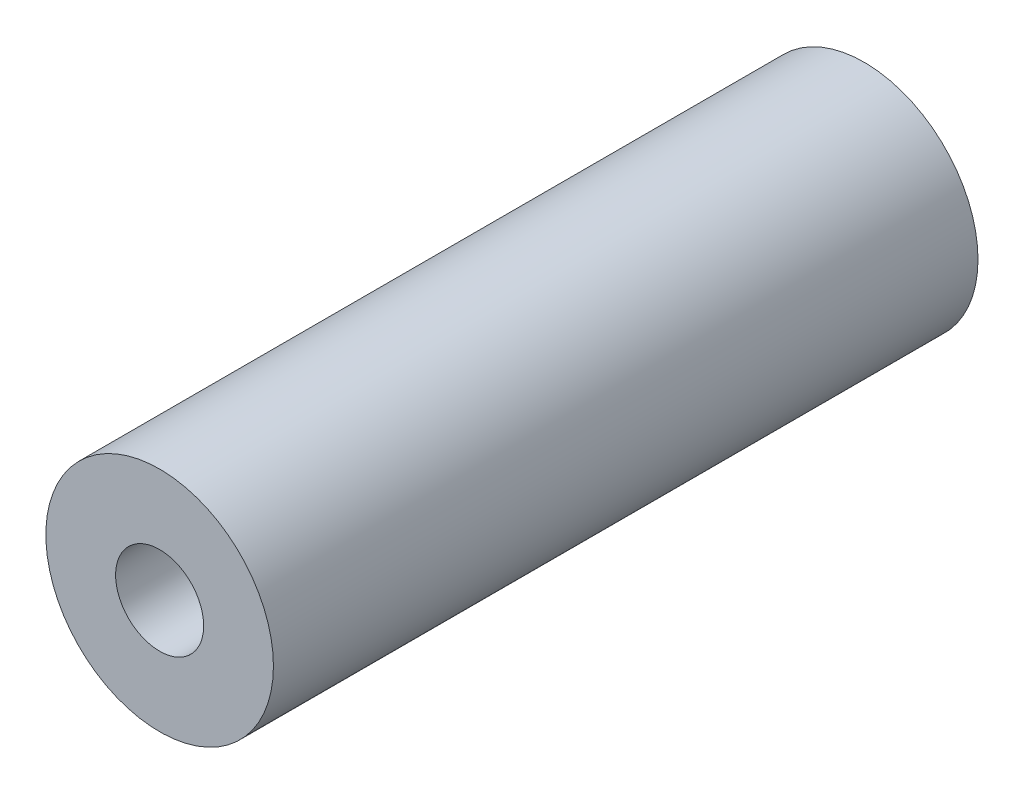
ISO-10303-21;
HEADER;
FILE_DESCRIPTION(('STEP AP214'),'2;1');
FILE_NAME('part.step','',(''),(''),'','','');
FILE_SCHEMA(('AUTOMOTIVE_DESIGN { 1 0 10303 214 1 1 1 1 }'));
ENDSEC;
DATA;
#1=APPLICATION_CONTEXT('core data for automotive mechanical design processes');
#2=APPLICATION_PROTOCOL_DEFINITION('international standard','automotive_design',2000,#1);
#3=PRODUCT_CONTEXT('',#1,'mechanical');
#4=PRODUCT('Part','Part','',(#3));
#5=PRODUCT_RELATED_PRODUCT_CATEGORY('part','',(#4));
#6=PRODUCT_DEFINITION_FORMATION('','',#4);
#7=PRODUCT_DEFINITION_CONTEXT('part definition',#1,'design');
#8=PRODUCT_DEFINITION('design','',#6,#7);
#9=PRODUCT_DEFINITION_SHAPE('','',#8);
#10=(LENGTH_UNIT() NAMED_UNIT(*) SI_UNIT(.MILLI.,.METRE.));
#11=(NAMED_UNIT(*) PLANE_ANGLE_UNIT() SI_UNIT($,.RADIAN.));
#12=(NAMED_UNIT(*) SI_UNIT($,.STERADIAN.) SOLID_ANGLE_UNIT());
#13=UNCERTAINTY_MEASURE_WITH_UNIT(LENGTH_MEASURE(1.E-05),#10,'distance_accuracy_value','');
#14=(GEOMETRIC_REPRESENTATION_CONTEXT(3) GLOBAL_UNCERTAINTY_ASSIGNED_CONTEXT((#13)) GLOBAL_UNIT_ASSIGNED_CONTEXT((#10,
#11,#12)) REPRESENTATION_CONTEXT('',''));
#15=CARTESIAN_POINT('',(0.,0.,0.));
#16=DIRECTION('',(0.,0.,1.));
#17=DIRECTION('',(1.,0.,0.));
#18=AXIS2_PLACEMENT_3D('',#15,#16,#17);
#19=CARTESIAN_POINT('',(-492.127121378298,1432.78731013692,0.));
#20=DIRECTION('',(0.,0.,1.));
#21=DIRECTION('',(1.,0.,0.));
#22=AXIS2_PLACEMENT_3D('',#19,#20,#21);
#23=PLANE('',#22);
#24=CARTESIAN_POINT('',(-492.127121378298,1432.78731013692,0.));
#25=DIRECTION('',(0.,0.,1.));
#26=DIRECTION('',(1.,0.,0.));
#27=AXIS2_PLACEMENT_3D('',#24,#25,#26);
#28=CIRCLE('',#27,16.4084);
#29=CARTESIAN_POINT('',(-475.718721378298,1432.78731013692,0.));
#30=VERTEX_POINT('',#29);
#31=EDGE_CURVE('E41',#30,#30,#28,.T.);
#32=ORIENTED_EDGE('',*,*,#31,.F.);
#33=EDGE_LOOP('',(#32));
#34=FACE_BOUND('',#33,.T.);
#35=CARTESIAN_POINT('',(-492.127121378298,1432.78731013692,0.));
#36=DIRECTION('',(0.,0.,1.));
#37=DIRECTION('',(1.,0.,0.));
#38=AXIS2_PLACEMENT_3D('',#35,#36,#37);
#39=CIRCLE('',#38,6.35000000000008);
#40=CARTESIAN_POINT('',(-485.777121378298,1432.78731013692,0.));
#41=VERTEX_POINT('',#40);
#42=EDGE_CURVE('E54',#41,#41,#39,.T.);
#43=ORIENTED_EDGE('',*,*,#42,.T.);
#44=EDGE_LOOP('',(#43));
#45=FACE_BOUND('',#44,.T.);
#46=ADVANCED_FACE('F34',(#34,#45),#23,.F.);
#47=CARTESIAN_POINT('',(-492.127121378298,2028.05100619533,101.599999999999));
#48=DIRECTION('',(0.,0.,1.));
#49=DIRECTION('',(1.,0.,0.));
#50=AXIS2_PLACEMENT_3D('',#47,#48,#49);
#51=PLANE('',#50);
#52=CARTESIAN_POINT('',(-492.127121378298,1432.78731013692,101.599999999999));
#53=DIRECTION('',(0.,0.,1.));
#54=DIRECTION('',(1.,0.,0.));
#55=AXIS2_PLACEMENT_3D('',#52,#53,#54);
#56=CIRCLE('',#55,16.4084);
#57=CARTESIAN_POINT('',(-475.718721378298,1432.78731013692,101.599999999999));
#58=VERTEX_POINT('',#57);
#59=EDGE_CURVE('E10',#58,#58,#56,.T.);
#60=ORIENTED_EDGE('',*,*,#59,.T.);
#61=EDGE_LOOP('',(#60));
#62=FACE_BOUND('',#61,.T.);
#63=CARTESIAN_POINT('',(-492.127121378298,1432.78731013692,101.599999999999));
#64=DIRECTION('',(0.,0.,1.));
#65=DIRECTION('',(1.,0.,0.));
#66=AXIS2_PLACEMENT_3D('',#63,#64,#65);
#67=CIRCLE('',#66,6.35000000000008);
#68=CARTESIAN_POINT('',(-485.777121378298,1432.78731013692,101.599999999999));
#69=VERTEX_POINT('',#68);
#70=EDGE_CURVE('E49',#69,#69,#67,.T.);
#71=ORIENTED_EDGE('',*,*,#70,.F.);
#72=EDGE_LOOP('',(#71));
#73=FACE_BOUND('',#72,.T.);
#74=ADVANCED_FACE('F36',(#62,#73),#51,.T.);
#75=CARTESIAN_POINT('',(-492.127121378298,1432.78731013692,148.009963633685));
#76=DIRECTION('',(0.,0.,-1.));
#77=DIRECTION('',(-1.,0.,0.));
#78=AXIS2_PLACEMENT_3D('',#75,#76,#77);
#79=CYLINDRICAL_SURFACE('',#78,16.4084);
#80=ORIENTED_EDGE('',*,*,#31,.T.);
#81=EDGE_LOOP('',(#80));
#82=FACE_BOUND('',#81,.T.);
#83=ORIENTED_EDGE('',*,*,#59,.F.);
#84=EDGE_LOOP('',(#83));
#85=FACE_BOUND('',#84,.T.);
#86=ADVANCED_FACE('F73',(#82,#85),#79,.T.);
#87=CARTESIAN_POINT('',(-492.127121378298,1445.38571013692,91.4399999999993));
#88=DIRECTION('',(0.,0.,-1.));
#89=DIRECTION('',(-1.,0.,0.));
#90=AXIS2_PLACEMENT_3D('',#87,#88,#89);
#91=PLANE('',#90);
#92=CARTESIAN_POINT('',(-492.127121378298,1432.78731013692,91.4399999999992));
#93=DIRECTION('',(0.,0.,1.));
#94=DIRECTION('',(1.,0.,0.));
#95=AXIS2_PLACEMENT_3D('',#92,#93,#94);
#96=CIRCLE('',#95,6.35000000000008);
#97=CARTESIAN_POINT('',(-485.777121378298,1432.78731013692,91.4399999999992));
#98=VERTEX_POINT('',#97);
#99=EDGE_CURVE('E45',#98,#98,#96,.T.);
#100=ORIENTED_EDGE('',*,*,#99,.T.);
#101=EDGE_LOOP('',(#100));
#102=FACE_BOUND('',#101,.T.);
#103=CARTESIAN_POINT('',(-492.127121378298,1432.78731013692,91.4399999999994));
#104=DIRECTION('',(0.,0.,1.));
#105=DIRECTION('',(1.,0.,0.));
#106=AXIS2_PLACEMENT_3D('',#103,#104,#105);
#107=CIRCLE('',#106,12.5983999999999);
#108=CARTESIAN_POINT('',(-479.528721378298,1432.78731013692,91.4399999999994));
#109=VERTEX_POINT('',#108);
#110=EDGE_CURVE('E63',#109,#109,#107,.T.);
#111=ORIENTED_EDGE('',*,*,#110,.F.);
#112=EDGE_LOOP('',(#111));
#113=FACE_BOUND('',#112,.T.);
#114=ADVANCED_FACE('F70',(#102,#113),#91,.T.);
#115=CARTESIAN_POINT('',(-492.127121378298,1432.78731013692,101.599999999999));
#116=DIRECTION('',(0.,0.,1.));
#117=DIRECTION('',(1.,0.,0.));
#118=AXIS2_PLACEMENT_3D('',#115,#116,#117);
#119=CYLINDRICAL_SURFACE('',#118,6.35000000000008);
#120=ORIENTED_EDGE('',*,*,#70,.T.);
#121=EDGE_LOOP('',(#120));
#122=FACE_BOUND('',#121,.T.);
#123=ORIENTED_EDGE('',*,*,#99,.F.);
#124=EDGE_LOOP('',(#123));
#125=FACE_BOUND('',#124,.T.);
#126=ADVANCED_FACE('F72',(#122,#125),#119,.F.);
#127=CARTESIAN_POINT('',(-492.127121378298,1432.78731013692,101.599999999999));
#128=DIRECTION('',(0.,0.,1.));
#129=DIRECTION('',(1.,0.,0.));
#130=AXIS2_PLACEMENT_3D('',#127,#128,#129);
#131=CYLINDRICAL_SURFACE('',#130,6.35000000000008);
#132=CARTESIAN_POINT('',(-492.127121378298,1432.78731013692,10.16));
#133=DIRECTION('',(0.,0.,1.));
#134=DIRECTION('',(1.,0.,0.));
#135=AXIS2_PLACEMENT_3D('',#132,#133,#134);
#136=CIRCLE('',#135,6.35000000000008);
#137=CARTESIAN_POINT('',(-485.777121378298,1432.78731013692,10.16));
#138=VERTEX_POINT('',#137);
#139=EDGE_CURVE('E57',#138,#138,#136,.T.);
#140=ORIENTED_EDGE('',*,*,#139,.T.);
#141=EDGE_LOOP('',(#140));
#142=FACE_BOUND('',#141,.T.);
#143=ORIENTED_EDGE('',*,*,#42,.F.);
#144=EDGE_LOOP('',(#143));
#145=FACE_BOUND('',#144,.T.);
#146=ADVANCED_FACE('F80',(#142,#145),#131,.F.);
#147=CARTESIAN_POINT('',(-492.127121378298,1445.38571013692,10.16));
#148=DIRECTION('',(0.,0.,1.));
#149=DIRECTION('',(1.,0.,0.));
#150=AXIS2_PLACEMENT_3D('',#147,#148,#149);
#151=PLANE('',#150);
#152=CARTESIAN_POINT('',(-492.127121378298,1432.78731013692,10.16));
#153=DIRECTION('',(0.,0.,1.));
#154=DIRECTION('',(1.,0.,0.));
#155=AXIS2_PLACEMENT_3D('',#152,#153,#154);
#156=CIRCLE('',#155,12.5983999999999);
#157=CARTESIAN_POINT('',(-479.528721378298,1432.78731013692,10.16));
#158=VERTEX_POINT('',#157);
#159=EDGE_CURVE('E60',#158,#158,#156,.T.);
#160=ORIENTED_EDGE('',*,*,#159,.T.);
#161=EDGE_LOOP('',(#160));
#162=FACE_BOUND('',#161,.T.);
#163=ORIENTED_EDGE('',*,*,#139,.F.);
#164=EDGE_LOOP('',(#163));
#165=FACE_BOUND('',#164,.T.);
#166=ADVANCED_FACE('F93',(#162,#165),#151,.T.);
#167=CARTESIAN_POINT('',(-492.127121378298,1432.78731013692,101.599999999999));
#168=DIRECTION('',(0.,0.,1.));
#169=DIRECTION('',(1.,0.,0.));
#170=AXIS2_PLACEMENT_3D('',#167,#168,#169);
#171=CYLINDRICAL_SURFACE('',#170,12.5983999999999);
#172=ORIENTED_EDGE('',*,*,#110,.T.);
#173=EDGE_LOOP('',(#172));
#174=FACE_BOUND('',#173,.T.);
#175=ORIENTED_EDGE('',*,*,#159,.F.);
#176=EDGE_LOOP('',(#175));
#177=FACE_BOUND('',#176,.T.);
#178=ADVANCED_FACE('F67',(#174,#177),#171,.F.);
#179=CLOSED_SHELL('',(#46,#74,#86,#114,#126,#146,#166,#178));
#180=MANIFOLD_SOLID_BREP('B2',#179);
#181=ADVANCED_BREP_SHAPE_REPRESENTATION('',(#18,#180),#14);
#182=SHAPE_DEFINITION_REPRESENTATION(#9,#181);
ENDSEC;
END-ISO-10303-21;
